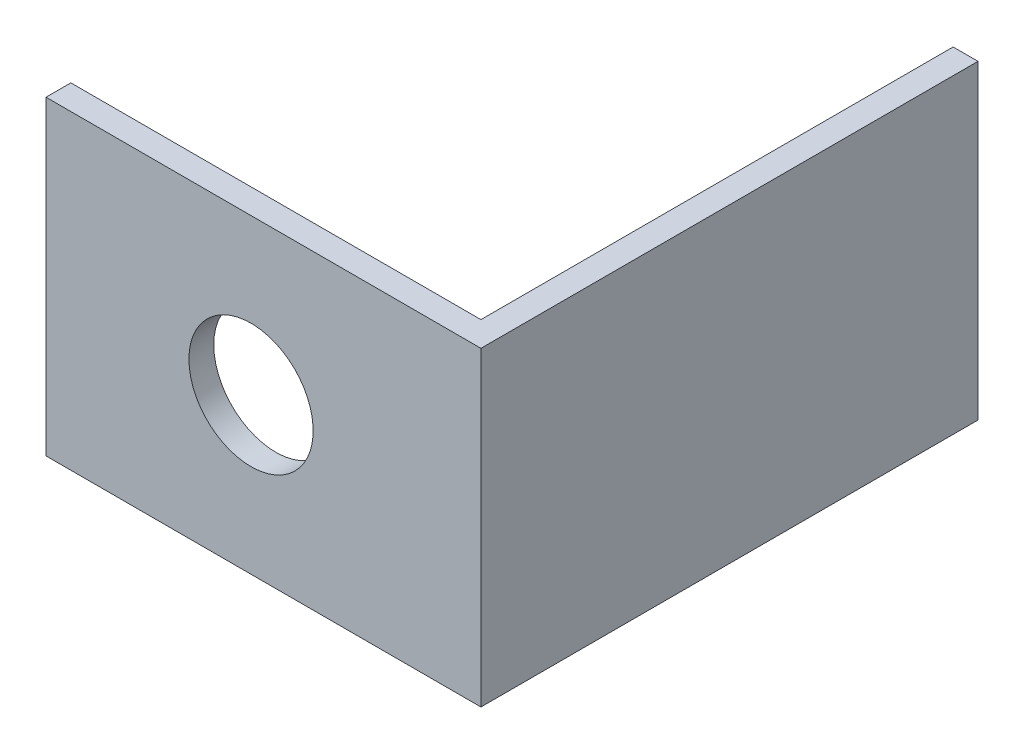
ISO-10303-21;
HEADER;
FILE_DESCRIPTION(('STEP AP214'),'2;1');
FILE_NAME('part.step','',(''),(''),'','','');
FILE_SCHEMA(('AUTOMOTIVE_DESIGN { 1 0 10303 214 1 1 1 1 }'));
ENDSEC;
DATA;
#1=APPLICATION_CONTEXT('core data for automotive mechanical design processes');
#2=APPLICATION_PROTOCOL_DEFINITION('international standard','automotive_design',2000,#1);
#3=PRODUCT_CONTEXT('',#1,'mechanical');
#4=PRODUCT('Part','Part','',(#3));
#5=PRODUCT_RELATED_PRODUCT_CATEGORY('part','',(#4));
#6=PRODUCT_DEFINITION_FORMATION('','',#4);
#7=PRODUCT_DEFINITION_CONTEXT('part definition',#1,'design');
#8=PRODUCT_DEFINITION('design','',#6,#7);
#9=PRODUCT_DEFINITION_SHAPE('','',#8);
#10=(LENGTH_UNIT() NAMED_UNIT(*) SI_UNIT(.MILLI.,.METRE.));
#11=(NAMED_UNIT(*) PLANE_ANGLE_UNIT() SI_UNIT($,.RADIAN.));
#12=(NAMED_UNIT(*) SI_UNIT($,.STERADIAN.) SOLID_ANGLE_UNIT());
#13=UNCERTAINTY_MEASURE_WITH_UNIT(LENGTH_MEASURE(1.E-05),#10,'distance_accuracy_value','');
#14=(GEOMETRIC_REPRESENTATION_CONTEXT(3) GLOBAL_UNCERTAINTY_ASSIGNED_CONTEXT((#13)) GLOBAL_UNIT_ASSIGNED_CONTEXT((#10,
#11,#12)) REPRESENTATION_CONTEXT('',''));
#15=CARTESIAN_POINT('',(0.,0.,0.));
#16=DIRECTION('',(0.,0.,1.));
#17=DIRECTION('',(1.,0.,0.));
#18=AXIS2_PLACEMENT_3D('',#15,#16,#17);
#19=CARTESIAN_POINT('',(0.,31.75,0.));
#20=DIRECTION('',(1.,0.,0.));
#21=DIRECTION('',(0.,0.,-1.));
#22=AXIS2_PLACEMENT_3D('',#19,#20,#21);
#23=PLANE('',#22);
#24=DIRECTION('',(0.,0.,1.));
#25=VECTOR('',#24,1.);
#26=CARTESIAN_POINT('',(0.,0.,0.));
#27=LINE('',#26,#25);
#28=CARTESIAN_POINT('',(0.,0.,-2.54));
#29=VERTEX_POINT('',#28);
#30=CARTESIAN_POINT('',(0.,0.,0.));
#31=VERTEX_POINT('',#30);
#32=EDGE_CURVE('E128',#29,#31,#27,.T.);
#33=ORIENTED_EDGE('',*,*,#32,.T.);
#34=DIRECTION('',(0.,-1.,0.));
#35=VECTOR('',#34,1.);
#36=CARTESIAN_POINT('',(0.,31.75,0.));
#37=LINE('',#36,#35);
#38=CARTESIAN_POINT('',(0.,31.75,0.));
#39=VERTEX_POINT('',#38);
#40=EDGE_CURVE('E11',#39,#31,#37,.T.);
#41=ORIENTED_EDGE('',*,*,#40,.F.);
#42=DIRECTION('',(0.,0.,1.));
#43=VECTOR('',#42,1.);
#44=CARTESIAN_POINT('',(0.,31.75,0.));
#45=LINE('',#44,#43);
#46=CARTESIAN_POINT('',(0.,31.75,-2.54));
#47=VERTEX_POINT('',#46);
#48=EDGE_CURVE('E145',#47,#39,#45,.T.);
#49=ORIENTED_EDGE('',*,*,#48,.F.);
#50=DIRECTION('',(0.,-1.,0.));
#51=VECTOR('',#50,1.);
#52=CARTESIAN_POINT('',(0.,31.75,-2.54));
#53=LINE('',#52,#51);
#54=EDGE_CURVE('E124',#47,#29,#53,.T.);
#55=ORIENTED_EDGE('',*,*,#54,.T.);
#56=EDGE_LOOP('',(#33,#41,#49,#55));
#57=FACE_BOUND('',#56,.T.);
#58=ADVANCED_FACE('F39',(#57),#23,.F.);
#59=CARTESIAN_POINT('',(0.,31.75,0.));
#60=DIRECTION('',(0.,0.,-1.));
#61=DIRECTION('',(-1.,0.,0.));
#62=AXIS2_PLACEMENT_3D('',#59,#60,#61);
#63=PLANE('',#62);
#64=CARTESIAN_POINT('',(20.955,15.875,0.));
#65=DIRECTION('',(0.,0.,-1.));
#66=DIRECTION('',(-1.,0.,0.));
#67=AXIS2_PLACEMENT_3D('',#64,#65,#66);
#68=CIRCLE('',#67,6.35);
#69=CARTESIAN_POINT('',(14.605,15.875,0.));
#70=VERTEX_POINT('',#69);
#71=EDGE_CURVE('E133',#70,#70,#68,.T.);
#72=ORIENTED_EDGE('',*,*,#71,.T.);
#73=EDGE_LOOP('',(#72));
#74=FACE_BOUND('',#73,.T.);
#75=DIRECTION('',(1.,0.,0.));
#76=VECTOR('',#75,1.);
#77=CARTESIAN_POINT('',(0.,0.,0.));
#78=LINE('',#77,#76);
#79=CARTESIAN_POINT('',(44.45,0.,0.));
#80=VERTEX_POINT('',#79);
#81=EDGE_CURVE('E132',#31,#80,#78,.T.);
#82=ORIENTED_EDGE('',*,*,#81,.T.);
#83=DIRECTION('',(0.,-1.,0.));
#84=VECTOR('',#83,1.);
#85=CARTESIAN_POINT('',(44.45,31.75,0.));
#86=LINE('',#85,#84);
#87=CARTESIAN_POINT('',(44.45,31.75,0.));
#88=VERTEX_POINT('',#87);
#89=EDGE_CURVE('E48',#88,#80,#86,.T.);
#90=ORIENTED_EDGE('',*,*,#89,.F.);
#91=DIRECTION('',(1.,0.,0.));
#92=VECTOR('',#91,1.);
#93=CARTESIAN_POINT('',(0.,31.75,0.));
#94=LINE('',#93,#92);
#95=EDGE_CURVE('E93',#39,#88,#94,.T.);
#96=ORIENTED_EDGE('',*,*,#95,.F.);
#97=ORIENTED_EDGE('',*,*,#40,.T.);
#98=EDGE_LOOP('',(#82,#90,#96,#97));
#99=FACE_BOUND('',#98,.T.);
#100=ADVANCED_FACE('F175',(#74,#99),#63,.F.);
#101=CARTESIAN_POINT('',(44.45,31.75,0.));
#102=DIRECTION('',(-1.,0.,0.));
#103=DIRECTION('',(0.,0.,1.));
#104=AXIS2_PLACEMENT_3D('',#101,#102,#103);
#105=PLANE('',#104);
#106=DIRECTION('',(0.,0.,-1.));
#107=VECTOR('',#106,1.);
#108=CARTESIAN_POINT('',(44.45,0.,0.));
#109=LINE('',#108,#107);
#110=CARTESIAN_POINT('',(44.45,0.,-50.8));
#111=VERTEX_POINT('',#110);
#112=EDGE_CURVE('E136',#80,#111,#109,.T.);
#113=ORIENTED_EDGE('',*,*,#112,.T.);
#114=DIRECTION('',(0.,-1.,0.));
#115=VECTOR('',#114,1.);
#116=CARTESIAN_POINT('',(44.45,31.75,-50.8));
#117=LINE('',#116,#115);
#118=CARTESIAN_POINT('',(44.45,31.75,-50.8));
#119=VERTEX_POINT('',#118);
#120=EDGE_CURVE('E117',#119,#111,#117,.T.);
#121=ORIENTED_EDGE('',*,*,#120,.F.);
#122=DIRECTION('',(0.,0.,-1.));
#123=VECTOR('',#122,1.);
#124=CARTESIAN_POINT('',(44.45,31.75,0.));
#125=LINE('',#124,#123);
#126=EDGE_CURVE('E106',#88,#119,#125,.T.);
#127=ORIENTED_EDGE('',*,*,#126,.F.);
#128=ORIENTED_EDGE('',*,*,#89,.T.);
#129=EDGE_LOOP('',(#113,#121,#127,#128));
#130=FACE_BOUND('',#129,.T.);
#131=ADVANCED_FACE('F155',(#130),#105,.F.);
#132=CARTESIAN_POINT('',(44.45,31.75,-50.8));
#133=DIRECTION('',(0.,0.,1.));
#134=DIRECTION('',(1.,0.,0.));
#135=AXIS2_PLACEMENT_3D('',#132,#133,#134);
#136=PLANE('',#135);
#137=DIRECTION('',(-1.,0.,0.));
#138=VECTOR('',#137,1.);
#139=CARTESIAN_POINT('',(44.45,0.,-50.8));
#140=LINE('',#139,#138);
#141=CARTESIAN_POINT('',(41.91,0.,-50.8));
#142=VERTEX_POINT('',#141);
#143=EDGE_CURVE('E115',#111,#142,#140,.T.);
#144=ORIENTED_EDGE('',*,*,#143,.T.);
#145=DIRECTION('',(0.,-1.,0.));
#146=VECTOR('',#145,1.);
#147=CARTESIAN_POINT('',(41.91,31.75,-50.8));
#148=LINE('',#147,#146);
#149=CARTESIAN_POINT('',(41.91,31.75,-50.8));
#150=VERTEX_POINT('',#149);
#151=EDGE_CURVE('E112',#150,#142,#148,.T.);
#152=ORIENTED_EDGE('',*,*,#151,.F.);
#153=DIRECTION('',(-1.,0.,0.));
#154=VECTOR('',#153,1.);
#155=CARTESIAN_POINT('',(44.45,31.75,-50.8));
#156=LINE('',#155,#154);
#157=EDGE_CURVE('E100',#119,#150,#156,.T.);
#158=ORIENTED_EDGE('',*,*,#157,.F.);
#159=ORIENTED_EDGE('',*,*,#120,.T.);
#160=EDGE_LOOP('',(#144,#152,#158,#159));
#161=FACE_BOUND('',#160,.T.);
#162=ADVANCED_FACE('F113',(#161),#136,.F.);
#163=CARTESIAN_POINT('',(41.91,31.75,-2.54));
#164=DIRECTION('',(1.,0.,0.));
#165=DIRECTION('',(0.,0.,-1.));
#166=AXIS2_PLACEMENT_3D('',#163,#164,#165);
#167=PLANE('',#166);
#168=DIRECTION('',(0.,0.,1.));
#169=VECTOR('',#168,1.);
#170=CARTESIAN_POINT('',(41.91,0.,-2.54));
#171=LINE('',#170,#169);
#172=CARTESIAN_POINT('',(41.91,0.,-2.54));
#173=VERTEX_POINT('',#172);
#174=EDGE_CURVE('E79',#142,#173,#171,.T.);
#175=ORIENTED_EDGE('',*,*,#174,.T.);
#176=DIRECTION('',(0.,-1.,0.));
#177=VECTOR('',#176,1.);
#178=CARTESIAN_POINT('',(41.91,31.75,-2.54));
#179=LINE('',#178,#177);
#180=CARTESIAN_POINT('',(41.91,31.75,-2.54));
#181=VERTEX_POINT('',#180);
#182=EDGE_CURVE('E118',#181,#173,#179,.T.);
#183=ORIENTED_EDGE('',*,*,#182,.F.);
#184=DIRECTION('',(0.,0.,1.));
#185=VECTOR('',#184,1.);
#186=CARTESIAN_POINT('',(41.91,31.75,-2.54));
#187=LINE('',#186,#185);
#188=EDGE_CURVE('E104',#150,#181,#187,.T.);
#189=ORIENTED_EDGE('',*,*,#188,.F.);
#190=ORIENTED_EDGE('',*,*,#151,.T.);
#191=EDGE_LOOP('',(#175,#183,#189,#190));
#192=FACE_BOUND('',#191,.T.);
#193=ADVANCED_FACE('F120',(#192),#167,.F.);
#194=CARTESIAN_POINT('',(0.,31.75,-2.54));
#195=DIRECTION('',(0.,0.,1.));
#196=DIRECTION('',(1.,0.,0.));
#197=AXIS2_PLACEMENT_3D('',#194,#195,#196);
#198=PLANE('',#197);
#199=CARTESIAN_POINT('',(20.955,15.875,-2.54));
#200=DIRECTION('',(0.,0.,-1.));
#201=DIRECTION('',(-1.,0.,0.));
#202=AXIS2_PLACEMENT_3D('',#199,#200,#201);
#203=CIRCLE('',#202,6.35);
#204=CARTESIAN_POINT('',(14.605,15.875,-2.54));
#205=VERTEX_POINT('',#204);
#206=EDGE_CURVE('E234',#205,#205,#203,.T.);
#207=ORIENTED_EDGE('',*,*,#206,.F.);
#208=EDGE_LOOP('',(#207));
#209=FACE_BOUND('',#208,.T.);
#210=DIRECTION('',(-1.,0.,0.));
#211=VECTOR('',#210,1.);
#212=CARTESIAN_POINT('',(0.,0.,-2.54));
#213=LINE('',#212,#211);
#214=EDGE_CURVE('E85',#173,#29,#213,.T.);
#215=ORIENTED_EDGE('',*,*,#214,.T.);
#216=ORIENTED_EDGE('',*,*,#54,.F.);
#217=DIRECTION('',(-1.,0.,0.));
#218=VECTOR('',#217,1.);
#219=CARTESIAN_POINT('',(0.,31.75,-2.54));
#220=LINE('',#219,#218);
#221=EDGE_CURVE('E56',#181,#47,#220,.T.);
#222=ORIENTED_EDGE('',*,*,#221,.F.);
#223=ORIENTED_EDGE('',*,*,#182,.T.);
#224=EDGE_LOOP('',(#215,#216,#222,#223));
#225=FACE_BOUND('',#224,.T.);
#226=ADVANCED_FACE('F162',(#209,#225),#198,.F.);
#227=CARTESIAN_POINT('',(0.,31.75,0.));
#228=DIRECTION('',(0.,-1.,0.));
#229=DIRECTION('',(0.,0.,-1.));
#230=AXIS2_PLACEMENT_3D('',#227,#228,#229);
#231=PLANE('',#230);
#232=ORIENTED_EDGE('',*,*,#48,.T.);
#233=ORIENTED_EDGE('',*,*,#95,.T.);
#234=ORIENTED_EDGE('',*,*,#126,.T.);
#235=ORIENTED_EDGE('',*,*,#157,.T.);
#236=ORIENTED_EDGE('',*,*,#188,.T.);
#237=ORIENTED_EDGE('',*,*,#221,.T.);
#238=EDGE_LOOP('',(#232,#233,#234,#235,#236,#237));
#239=FACE_BOUND('',#238,.T.);
#240=ADVANCED_FACE('F102',(#239),#231,.F.);
#241=CARTESIAN_POINT('',(0.,0.,0.));
#242=DIRECTION('',(0.,-1.,0.));
#243=DIRECTION('',(0.,0.,-1.));
#244=AXIS2_PLACEMENT_3D('',#241,#242,#243);
#245=PLANE('',#244);
#246=ORIENTED_EDGE('',*,*,#32,.F.);
#247=ORIENTED_EDGE('',*,*,#214,.F.);
#248=ORIENTED_EDGE('',*,*,#174,.F.);
#249=ORIENTED_EDGE('',*,*,#143,.F.);
#250=ORIENTED_EDGE('',*,*,#112,.F.);
#251=ORIENTED_EDGE('',*,*,#81,.F.);
#252=EDGE_LOOP('',(#246,#247,#248,#249,#250,#251));
#253=FACE_BOUND('',#252,.T.);
#254=ADVANCED_FACE('F158',(#253),#245,.T.);
#255=CARTESIAN_POINT('',(20.955,15.875,29.21));
#256=DIRECTION('',(0.,0.,-1.));
#257=DIRECTION('',(-1.,0.,0.));
#258=AXIS2_PLACEMENT_3D('',#255,#256,#257);
#259=CYLINDRICAL_SURFACE('',#258,6.35);
#260=ORIENTED_EDGE('',*,*,#206,.T.);
#261=EDGE_LOOP('',(#260));
#262=FACE_BOUND('',#261,.T.);
#263=ORIENTED_EDGE('',*,*,#71,.F.);
#264=EDGE_LOOP('',(#263));
#265=FACE_BOUND('',#264,.T.);
#266=ADVANCED_FACE('F210',(#262,#265),#259,.F.);
#267=CLOSED_SHELL('',(#58,#100,#131,#162,#193,#226,#240,#254,#266));
#268=MANIFOLD_SOLID_BREP('B2',#267);
#269=ADVANCED_BREP_SHAPE_REPRESENTATION('',(#18,#268),#14);
#270=SHAPE_DEFINITION_REPRESENTATION(#9,#269);
ENDSEC;
END-ISO-10303-21;
